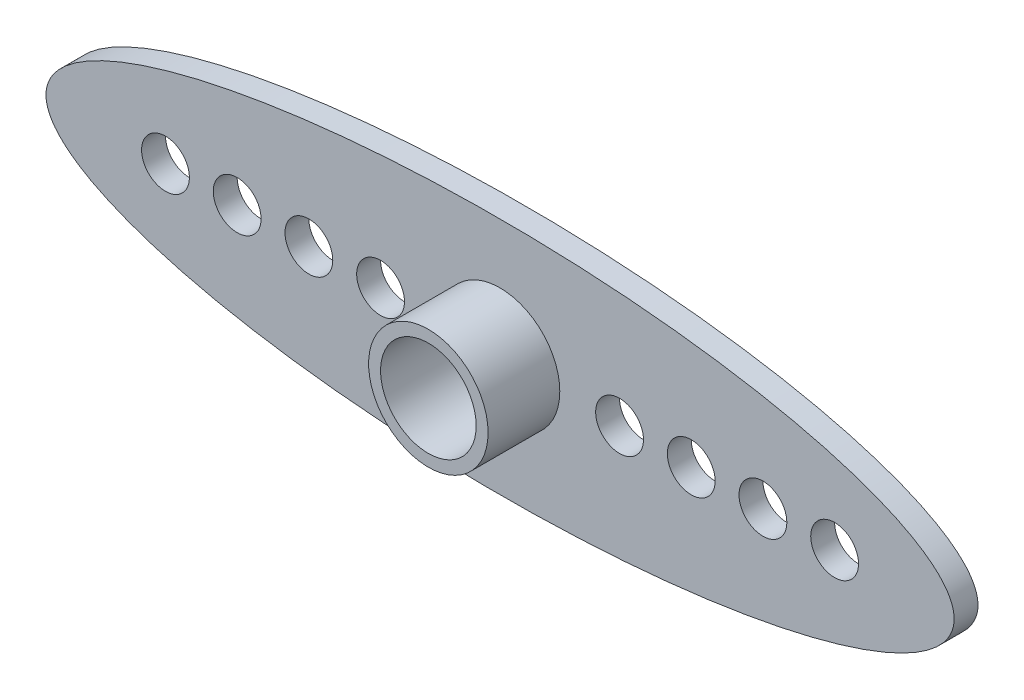
ISO-10303-21;
HEADER;
FILE_DESCRIPTION(('STEP AP214'),'2;1');
FILE_NAME('part.step','',(''),(''),'','','');
FILE_SCHEMA(('AUTOMOTIVE_DESIGN { 1 0 10303 214 1 1 1 1 }'));
ENDSEC;
DATA;
#1=APPLICATION_CONTEXT('core data for automotive mechanical design processes');
#2=APPLICATION_PROTOCOL_DEFINITION('international standard','automotive_design',2000,#1);
#3=PRODUCT_CONTEXT('',#1,'mechanical');
#4=PRODUCT('Part','Part','',(#3));
#5=PRODUCT_RELATED_PRODUCT_CATEGORY('part','',(#4));
#6=PRODUCT_DEFINITION_FORMATION('','',#4);
#7=PRODUCT_DEFINITION_CONTEXT('part definition',#1,'design');
#8=PRODUCT_DEFINITION('design','',#6,#7);
#9=PRODUCT_DEFINITION_SHAPE('','',#8);
#10=(LENGTH_UNIT() NAMED_UNIT(*) SI_UNIT(.MILLI.,.METRE.));
#11=(NAMED_UNIT(*) PLANE_ANGLE_UNIT() SI_UNIT($,.RADIAN.));
#12=(NAMED_UNIT(*) SI_UNIT($,.STERADIAN.) SOLID_ANGLE_UNIT());
#13=UNCERTAINTY_MEASURE_WITH_UNIT(LENGTH_MEASURE(1.E-05),#10,'distance_accuracy_value','');
#14=(GEOMETRIC_REPRESENTATION_CONTEXT(3) GLOBAL_UNCERTAINTY_ASSIGNED_CONTEXT((#13)) GLOBAL_UNIT_ASSIGNED_CONTEXT((#10,
#11,#12)) REPRESENTATION_CONTEXT('',''));
#15=CARTESIAN_POINT('',(0.,0.,0.));
#16=DIRECTION('',(0.,0.,1.));
#17=DIRECTION('',(1.,0.,0.));
#18=AXIS2_PLACEMENT_3D('',#15,#16,#17);
#19=CARTESIAN_POINT('',(0.,0.,0.));
#20=DIRECTION('',(0.,0.,1.));
#21=DIRECTION('',(1.,0.,0.));
#22=AXIS2_PLACEMENT_3D('',#19,#20,#21);
#23=PLANE('',#22);
#24=CARTESIAN_POINT('',(0.,0.,0.));
#25=DIRECTION('',(0.,0.,-1.));
#26=DIRECTION('',(-1.,0.,0.));
#27=AXIS2_PLACEMENT_3D('',#24,#25,#26);
#28=CIRCLE('',#27,1.5);
#29=CARTESIAN_POINT('',(-1.5,0.,0.));
#30=VERTEX_POINT('',#29);
#31=EDGE_CURVE('E56',#30,#30,#28,.T.);
#32=ORIENTED_EDGE('',*,*,#31,.F.);
#33=EDGE_LOOP('',(#32));
#34=FACE_BOUND('',#33,.T.);
#35=CARTESIAN_POINT('',(0.,0.,0.));
#36=DIRECTION('',(0.,0.,-1.));
#37=DIRECTION('',(-1.,0.,0.));
#38=AXIS2_PLACEMENT_3D('',#35,#36,#37);
#39=CIRCLE('',#38,2.);
#40=CARTESIAN_POINT('',(-2.,0.,0.));
#41=VERTEX_POINT('',#40);
#42=EDGE_CURVE('E150',#41,#41,#39,.T.);
#43=ORIENTED_EDGE('',*,*,#42,.T.);
#44=EDGE_LOOP('',(#43));
#45=FACE_BOUND('',#44,.T.);
#46=ADVANCED_FACE('F31',(#34,#45),#23,.F.);
#47=CARTESIAN_POINT('',(0.,0.,1.));
#48=DIRECTION('',(0.,0.,1.));
#49=DIRECTION('',(-1.,0.,0.));
#50=AXIS2_PLACEMENT_3D('',#47,#48,#49);
#51=ELLIPSE('',#50,19.,5.);
#52=DIRECTION('',(0.,0.,-1.));
#53=VECTOR('',#52,1.);
#54=SURFACE_OF_LINEAR_EXTRUSION('',#51,#53);
#55=CARTESIAN_POINT('',(-19.,0.,1.));
#56=VERTEX_POINT('',#55);
#57=EDGE_CURVE('E39',#56,#56,#51,.T.);
#58=ORIENTED_EDGE('',*,*,#57,.F.);
#59=EDGE_LOOP('',(#58));
#60=FACE_BOUND('',#59,.T.);
#61=CARTESIAN_POINT('',(0.,0.,0.));
#62=DIRECTION('',(0.,0.,1.));
#63=DIRECTION('',(-1.,0.,0.));
#64=AXIS2_PLACEMENT_3D('',#61,#62,#63);
#65=ELLIPSE('',#64,19.,5.);
#66=CARTESIAN_POINT('',(-19.,0.,0.));
#67=VERTEX_POINT('',#66);
#68=EDGE_CURVE('E43',#67,#67,#65,.T.);
#69=ORIENTED_EDGE('',*,*,#68,.T.);
#70=EDGE_LOOP('',(#69));
#71=FACE_BOUND('',#70,.T.);
#72=ADVANCED_FACE('F33',(#60,#71),#54,.F.);
#73=CARTESIAN_POINT('',(0.,0.,1.));
#74=DIRECTION('',(0.,0.,1.));
#75=DIRECTION('',(1.,0.,0.));
#76=AXIS2_PLACEMENT_3D('',#73,#74,#75);
#77=PLANE('',#76);
#78=CARTESIAN_POINT('',(-5.,0.,1.));
#79=DIRECTION('',(0.,0.,1.));
#80=DIRECTION('',(1.,0.,0.));
#81=AXIS2_PLACEMENT_3D('',#78,#79,#80);
#82=CIRCLE('',#81,1.);
#83=CARTESIAN_POINT('',(-4.,0.,1.));
#84=VERTEX_POINT('',#83);
#85=EDGE_CURVE('E77',#84,#84,#82,.T.);
#86=ORIENTED_EDGE('',*,*,#85,.F.);
#87=EDGE_LOOP('',(#86));
#88=FACE_BOUND('',#87,.T.);
#89=CARTESIAN_POINT('',(-8.,0.,1.));
#90=DIRECTION('',(0.,0.,1.));
#91=DIRECTION('',(1.,0.,0.));
#92=AXIS2_PLACEMENT_3D('',#89,#90,#91);
#93=CIRCLE('',#92,1.);
#94=CARTESIAN_POINT('',(-7.,0.,1.));
#95=VERTEX_POINT('',#94);
#96=EDGE_CURVE('E83',#95,#95,#93,.T.);
#97=ORIENTED_EDGE('',*,*,#96,.F.);
#98=EDGE_LOOP('',(#97));
#99=FACE_BOUND('',#98,.T.);
#100=CARTESIAN_POINT('',(-11.,0.,1.));
#101=DIRECTION('',(0.,0.,1.));
#102=DIRECTION('',(1.,0.,0.));
#103=AXIS2_PLACEMENT_3D('',#100,#101,#102);
#104=CIRCLE('',#103,1.);
#105=CARTESIAN_POINT('',(-10.,0.,1.));
#106=VERTEX_POINT('',#105);
#107=EDGE_CURVE('E89',#106,#106,#104,.T.);
#108=ORIENTED_EDGE('',*,*,#107,.F.);
#109=EDGE_LOOP('',(#108));
#110=FACE_BOUND('',#109,.T.);
#111=CARTESIAN_POINT('',(-14.,0.,1.));
#112=DIRECTION('',(0.,0.,1.));
#113=DIRECTION('',(1.,0.,0.));
#114=AXIS2_PLACEMENT_3D('',#111,#112,#113);
#115=CIRCLE('',#114,1.);
#116=CARTESIAN_POINT('',(-13.,0.,1.));
#117=VERTEX_POINT('',#116);
#118=EDGE_CURVE('E95',#117,#117,#115,.T.);
#119=ORIENTED_EDGE('',*,*,#118,.F.);
#120=EDGE_LOOP('',(#119));
#121=FACE_BOUND('',#120,.T.);
#122=CARTESIAN_POINT('',(14.,0.,1.));
#123=DIRECTION('',(0.,0.,1.));
#124=DIRECTION('',(1.,0.,0.));
#125=AXIS2_PLACEMENT_3D('',#122,#123,#124);
#126=CIRCLE('',#125,1.);
#127=CARTESIAN_POINT('',(15.,0.,1.));
#128=VERTEX_POINT('',#127);
#129=EDGE_CURVE('E101',#128,#128,#126,.T.);
#130=ORIENTED_EDGE('',*,*,#129,.F.);
#131=EDGE_LOOP('',(#130));
#132=FACE_BOUND('',#131,.T.);
#133=CARTESIAN_POINT('',(11.,0.,1.));
#134=DIRECTION('',(0.,0.,1.));
#135=DIRECTION('',(1.,0.,0.));
#136=AXIS2_PLACEMENT_3D('',#133,#134,#135);
#137=CIRCLE('',#136,1.);
#138=CARTESIAN_POINT('',(12.,0.,1.));
#139=VERTEX_POINT('',#138);
#140=EDGE_CURVE('E107',#139,#139,#137,.T.);
#141=ORIENTED_EDGE('',*,*,#140,.F.);
#142=EDGE_LOOP('',(#141));
#143=FACE_BOUND('',#142,.T.);
#144=CARTESIAN_POINT('',(8.,0.,1.));
#145=DIRECTION('',(0.,0.,1.));
#146=DIRECTION('',(1.,0.,0.));
#147=AXIS2_PLACEMENT_3D('',#144,#145,#146);
#148=CIRCLE('',#147,1.);
#149=CARTESIAN_POINT('',(9.,0.,1.));
#150=VERTEX_POINT('',#149);
#151=EDGE_CURVE('E113',#150,#150,#148,.T.);
#152=ORIENTED_EDGE('',*,*,#151,.F.);
#153=EDGE_LOOP('',(#152));
#154=FACE_BOUND('',#153,.T.);
#155=CARTESIAN_POINT('',(5.,0.,1.));
#156=DIRECTION('',(0.,0.,1.));
#157=DIRECTION('',(1.,0.,0.));
#158=AXIS2_PLACEMENT_3D('',#155,#156,#157);
#159=CIRCLE('',#158,1.);
#160=CARTESIAN_POINT('',(6.,0.,1.));
#161=VERTEX_POINT('',#160);
#162=EDGE_CURVE('E119',#161,#161,#159,.T.);
#163=ORIENTED_EDGE('',*,*,#162,.F.);
#164=EDGE_LOOP('',(#163));
#165=FACE_BOUND('',#164,.T.);
#166=CARTESIAN_POINT('',(0.,0.,1.));
#167=DIRECTION('',(0.,0.,1.));
#168=DIRECTION('',(1.,0.,0.));
#169=AXIS2_PLACEMENT_3D('',#166,#167,#168);
#170=CIRCLE('',#169,2.5);
#171=CARTESIAN_POINT('',(2.5,0.,1.));
#172=VERTEX_POINT('',#171);
#173=EDGE_CURVE('E51',#172,#172,#170,.T.);
#174=ORIENTED_EDGE('',*,*,#173,.F.);
#175=EDGE_LOOP('',(#174));
#176=FACE_BOUND('',#175,.T.);
#177=ORIENTED_EDGE('',*,*,#57,.T.);
#178=EDGE_LOOP('',(#177));
#179=FACE_BOUND('',#178,.T.);
#180=ADVANCED_FACE('F129',(#88,#99,#110,#121,#132,#143,#154,#165,#176,#179),#77,.T.);
#181=CARTESIAN_POINT('',(0.,0.,0.));
#182=DIRECTION('',(0.,0.,1.));
#183=DIRECTION('',(1.,0.,0.));
#184=AXIS2_PLACEMENT_3D('',#181,#182,#183);
#185=CIRCLE('',#184,2.5);
#186=CARTESIAN_POINT('',(2.5,0.,0.));
#187=VERTEX_POINT('',#186);
#188=EDGE_CURVE('E10',#187,#187,#185,.F.);
#189=ORIENTED_EDGE('',*,*,#188,.F.);
#190=EDGE_LOOP('',(#189));
#191=FACE_BOUND('',#190,.T.);
#192=CARTESIAN_POINT('',(-5.,0.,0.));
#193=DIRECTION('',(0.,0.,-1.));
#194=DIRECTION('',(1.,0.,0.));
#195=AXIS2_PLACEMENT_3D('',#192,#193,#194);
#196=CIRCLE('',#195,1.);
#197=CARTESIAN_POINT('',(-4.,0.,0.));
#198=VERTEX_POINT('',#197);
#199=EDGE_CURVE('E73',#198,#198,#196,.T.);
#200=ORIENTED_EDGE('',*,*,#199,.F.);
#201=EDGE_LOOP('',(#200));
#202=FACE_BOUND('',#201,.T.);
#203=CARTESIAN_POINT('',(-8.,0.,0.));
#204=DIRECTION('',(0.,0.,-1.));
#205=DIRECTION('',(1.,0.,0.));
#206=AXIS2_PLACEMENT_3D('',#203,#204,#205);
#207=CIRCLE('',#206,1.);
#208=CARTESIAN_POINT('',(-7.,0.,0.));
#209=VERTEX_POINT('',#208);
#210=EDGE_CURVE('E80',#209,#209,#207,.T.);
#211=ORIENTED_EDGE('',*,*,#210,.F.);
#212=EDGE_LOOP('',(#211));
#213=FACE_BOUND('',#212,.T.);
#214=CARTESIAN_POINT('',(-11.,0.,0.));
#215=DIRECTION('',(0.,0.,-1.));
#216=DIRECTION('',(1.,0.,0.));
#217=AXIS2_PLACEMENT_3D('',#214,#215,#216);
#218=CIRCLE('',#217,1.);
#219=CARTESIAN_POINT('',(-10.,0.,0.));
#220=VERTEX_POINT('',#219);
#221=EDGE_CURVE('E86',#220,#220,#218,.T.);
#222=ORIENTED_EDGE('',*,*,#221,.F.);
#223=EDGE_LOOP('',(#222));
#224=FACE_BOUND('',#223,.T.);
#225=CARTESIAN_POINT('',(-14.,0.,0.));
#226=DIRECTION('',(0.,0.,-1.));
#227=DIRECTION('',(1.,0.,0.));
#228=AXIS2_PLACEMENT_3D('',#225,#226,#227);
#229=CIRCLE('',#228,1.);
#230=CARTESIAN_POINT('',(-13.,0.,0.));
#231=VERTEX_POINT('',#230);
#232=EDGE_CURVE('E92',#231,#231,#229,.T.);
#233=ORIENTED_EDGE('',*,*,#232,.F.);
#234=EDGE_LOOP('',(#233));
#235=FACE_BOUND('',#234,.T.);
#236=CARTESIAN_POINT('',(14.,0.,0.));
#237=DIRECTION('',(0.,0.,-1.));
#238=DIRECTION('',(-1.,0.,0.));
#239=AXIS2_PLACEMENT_3D('',#236,#237,#238);
#240=CIRCLE('',#239,1.);
#241=CARTESIAN_POINT('',(13.,0.,0.));
#242=VERTEX_POINT('',#241);
#243=EDGE_CURVE('E98',#242,#242,#240,.T.);
#244=ORIENTED_EDGE('',*,*,#243,.F.);
#245=EDGE_LOOP('',(#244));
#246=FACE_BOUND('',#245,.T.);
#247=CARTESIAN_POINT('',(11.,0.,0.));
#248=DIRECTION('',(0.,0.,-1.));
#249=DIRECTION('',(-1.,0.,0.));
#250=AXIS2_PLACEMENT_3D('',#247,#248,#249);
#251=CIRCLE('',#250,1.);
#252=CARTESIAN_POINT('',(10.,0.,0.));
#253=VERTEX_POINT('',#252);
#254=EDGE_CURVE('E104',#253,#253,#251,.T.);
#255=ORIENTED_EDGE('',*,*,#254,.F.);
#256=EDGE_LOOP('',(#255));
#257=FACE_BOUND('',#256,.T.);
#258=CARTESIAN_POINT('',(8.,0.,0.));
#259=DIRECTION('',(0.,0.,-1.));
#260=DIRECTION('',(-1.,0.,0.));
#261=AXIS2_PLACEMENT_3D('',#258,#259,#260);
#262=CIRCLE('',#261,1.);
#263=CARTESIAN_POINT('',(7.,0.,0.));
#264=VERTEX_POINT('',#263);
#265=EDGE_CURVE('E110',#264,#264,#262,.T.);
#266=ORIENTED_EDGE('',*,*,#265,.F.);
#267=EDGE_LOOP('',(#266));
#268=FACE_BOUND('',#267,.T.);
#269=CARTESIAN_POINT('',(5.,0.,0.));
#270=DIRECTION('',(0.,0.,-1.));
#271=DIRECTION('',(-1.,0.,0.));
#272=AXIS2_PLACEMENT_3D('',#269,#270,#271);
#273=CIRCLE('',#272,1.);
#274=CARTESIAN_POINT('',(4.,0.,0.));
#275=VERTEX_POINT('',#274);
#276=EDGE_CURVE('E116',#275,#275,#273,.T.);
#277=ORIENTED_EDGE('',*,*,#276,.F.);
#278=EDGE_LOOP('',(#277));
#279=FACE_BOUND('',#278,.T.);
#280=ORIENTED_EDGE('',*,*,#68,.F.);
#281=EDGE_LOOP('',(#280));
#282=FACE_BOUND('',#281,.T.);
#283=ADVANCED_FACE('F131',(#191,#202,#213,#224,#235,#246,#257,#268,#279,#282),#23,.F.);
#284=CARTESIAN_POINT('',(0.,0.,4.));
#285=DIRECTION('',(0.,0.,-1.));
#286=DIRECTION('',(-1.,0.,0.));
#287=AXIS2_PLACEMENT_3D('',#284,#285,#286);
#288=CYLINDRICAL_SURFACE('',#287,2.5);
#289=CARTESIAN_POINT('',(0.,0.,4.));
#290=DIRECTION('',(0.,0.,1.));
#291=DIRECTION('',(1.,0.,0.));
#292=AXIS2_PLACEMENT_3D('',#289,#290,#291);
#293=CIRCLE('',#292,2.5);
#294=CARTESIAN_POINT('',(2.5,0.,4.));
#295=VERTEX_POINT('',#294);
#296=EDGE_CURVE('E47',#295,#295,#293,.T.);
#297=ORIENTED_EDGE('',*,*,#296,.F.);
#298=EDGE_LOOP('',(#297));
#299=FACE_BOUND('',#298,.T.);
#300=ORIENTED_EDGE('',*,*,#173,.T.);
#301=EDGE_LOOP('',(#300));
#302=FACE_BOUND('',#301,.T.);
#303=ADVANCED_FACE('F127',(#299,#302),#288,.T.);
#304=CARTESIAN_POINT('',(0.,0.,4.));
#305=DIRECTION('',(0.,0.,1.));
#306=DIRECTION('',(1.,0.,0.));
#307=AXIS2_PLACEMENT_3D('',#304,#305,#306);
#308=PLANE('',#307);
#309=CARTESIAN_POINT('',(0.,0.,4.));
#310=DIRECTION('',(0.,0.,1.));
#311=DIRECTION('',(1.,0.,0.));
#312=AXIS2_PLACEMENT_3D('',#309,#310,#311);
#313=CIRCLE('',#312,2.);
#314=CARTESIAN_POINT('',(2.,0.,4.));
#315=VERTEX_POINT('',#314);
#316=EDGE_CURVE('E55',#315,#315,#313,.T.);
#317=ORIENTED_EDGE('',*,*,#316,.F.);
#318=EDGE_LOOP('',(#317));
#319=FACE_BOUND('',#318,.T.);
#320=ORIENTED_EDGE('',*,*,#296,.T.);
#321=EDGE_LOOP('',(#320));
#322=FACE_BOUND('',#321,.T.);
#323=ADVANCED_FACE('F212',(#319,#322),#308,.T.);
#324=CARTESIAN_POINT('',(5.,0.,4.));
#325=DIRECTION('',(0.,0.,-1.));
#326=DIRECTION('',(-1.,0.,0.));
#327=AXIS2_PLACEMENT_3D('',#324,#325,#326);
#328=CYLINDRICAL_SURFACE('',#327,1.);
#329=ORIENTED_EDGE('',*,*,#162,.T.);
#330=EDGE_LOOP('',(#329));
#331=FACE_BOUND('',#330,.T.);
#332=ORIENTED_EDGE('',*,*,#276,.T.);
#333=EDGE_LOOP('',(#332));
#334=FACE_BOUND('',#333,.T.);
#335=ADVANCED_FACE('F208',(#331,#334),#328,.F.);
#336=CARTESIAN_POINT('',(8.,0.,4.));
#337=DIRECTION('',(0.,0.,-1.));
#338=DIRECTION('',(-1.,0.,0.));
#339=AXIS2_PLACEMENT_3D('',#336,#337,#338);
#340=CYLINDRICAL_SURFACE('',#339,1.);
#341=ORIENTED_EDGE('',*,*,#151,.T.);
#342=EDGE_LOOP('',(#341));
#343=FACE_BOUND('',#342,.T.);
#344=ORIENTED_EDGE('',*,*,#265,.T.);
#345=EDGE_LOOP('',(#344));
#346=FACE_BOUND('',#345,.T.);
#347=ADVANCED_FACE('F204',(#343,#346),#340,.F.);
#348=CARTESIAN_POINT('',(11.,0.,4.));
#349=DIRECTION('',(0.,0.,-1.));
#350=DIRECTION('',(-1.,0.,0.));
#351=AXIS2_PLACEMENT_3D('',#348,#349,#350);
#352=CYLINDRICAL_SURFACE('',#351,1.);
#353=ORIENTED_EDGE('',*,*,#140,.T.);
#354=EDGE_LOOP('',(#353));
#355=FACE_BOUND('',#354,.T.);
#356=ORIENTED_EDGE('',*,*,#254,.T.);
#357=EDGE_LOOP('',(#356));
#358=FACE_BOUND('',#357,.T.);
#359=ADVANCED_FACE('F200',(#355,#358),#352,.F.);
#360=CARTESIAN_POINT('',(14.,0.,4.));
#361=DIRECTION('',(0.,0.,-1.));
#362=DIRECTION('',(-1.,0.,0.));
#363=AXIS2_PLACEMENT_3D('',#360,#361,#362);
#364=CYLINDRICAL_SURFACE('',#363,1.);
#365=ORIENTED_EDGE('',*,*,#129,.T.);
#366=EDGE_LOOP('',(#365));
#367=FACE_BOUND('',#366,.T.);
#368=ORIENTED_EDGE('',*,*,#243,.T.);
#369=EDGE_LOOP('',(#368));
#370=FACE_BOUND('',#369,.T.);
#371=ADVANCED_FACE('F196',(#367,#370),#364,.F.);
#372=CARTESIAN_POINT('',(-14.,0.,4.));
#373=DIRECTION('',(0.,0.,-1.));
#374=DIRECTION('',(-1.,0.,0.));
#375=AXIS2_PLACEMENT_3D('',#372,#373,#374);
#376=CYLINDRICAL_SURFACE('',#375,1.);
#377=ORIENTED_EDGE('',*,*,#118,.T.);
#378=EDGE_LOOP('',(#377));
#379=FACE_BOUND('',#378,.T.);
#380=ORIENTED_EDGE('',*,*,#232,.T.);
#381=EDGE_LOOP('',(#380));
#382=FACE_BOUND('',#381,.T.);
#383=ADVANCED_FACE('F192',(#379,#382),#376,.F.);
#384=CARTESIAN_POINT('',(-11.,0.,4.));
#385=DIRECTION('',(0.,0.,-1.));
#386=DIRECTION('',(-1.,0.,0.));
#387=AXIS2_PLACEMENT_3D('',#384,#385,#386);
#388=CYLINDRICAL_SURFACE('',#387,1.);
#389=ORIENTED_EDGE('',*,*,#107,.T.);
#390=EDGE_LOOP('',(#389));
#391=FACE_BOUND('',#390,.T.);
#392=ORIENTED_EDGE('',*,*,#221,.T.);
#393=EDGE_LOOP('',(#392));
#394=FACE_BOUND('',#393,.T.);
#395=ADVANCED_FACE('F188',(#391,#394),#388,.F.);
#396=CARTESIAN_POINT('',(-8.,0.,4.));
#397=DIRECTION('',(0.,0.,-1.));
#398=DIRECTION('',(-1.,0.,0.));
#399=AXIS2_PLACEMENT_3D('',#396,#397,#398);
#400=CYLINDRICAL_SURFACE('',#399,1.);
#401=ORIENTED_EDGE('',*,*,#96,.T.);
#402=EDGE_LOOP('',(#401));
#403=FACE_BOUND('',#402,.T.);
#404=ORIENTED_EDGE('',*,*,#210,.T.);
#405=EDGE_LOOP('',(#404));
#406=FACE_BOUND('',#405,.T.);
#407=ADVANCED_FACE('F184',(#403,#406),#400,.F.);
#408=CARTESIAN_POINT('',(-5.,0.,4.));
#409=DIRECTION('',(0.,0.,-1.));
#410=DIRECTION('',(-1.,0.,0.));
#411=AXIS2_PLACEMENT_3D('',#408,#409,#410);
#412=CYLINDRICAL_SURFACE('',#411,1.);
#413=ORIENTED_EDGE('',*,*,#85,.T.);
#414=EDGE_LOOP('',(#413));
#415=FACE_BOUND('',#414,.T.);
#416=ORIENTED_EDGE('',*,*,#199,.T.);
#417=EDGE_LOOP('',(#416));
#418=FACE_BOUND('',#417,.T.);
#419=ADVANCED_FACE('F180',(#415,#418),#412,.F.);
#420=CARTESIAN_POINT('',(0.,0.,1.));
#421=DIRECTION('',(0.,0.,1.));
#422=DIRECTION('',(1.,0.,0.));
#423=AXIS2_PLACEMENT_3D('',#420,#421,#422);
#424=CYLINDRICAL_SURFACE('',#423,2.);
#425=CARTESIAN_POINT('',(0.,0.,1.));
#426=DIRECTION('',(0.,0.,1.));
#427=DIRECTION('',(1.,0.,0.));
#428=AXIS2_PLACEMENT_3D('',#425,#426,#427);
#429=CIRCLE('',#428,2.);
#430=CARTESIAN_POINT('',(2.,0.,1.));
#431=VERTEX_POINT('',#430);
#432=EDGE_CURVE('E60',#431,#431,#429,.T.);
#433=ORIENTED_EDGE('',*,*,#432,.F.);
#434=EDGE_LOOP('',(#433));
#435=FACE_BOUND('',#434,.T.);
#436=ORIENTED_EDGE('',*,*,#316,.T.);
#437=EDGE_LOOP('',(#436));
#438=FACE_BOUND('',#437,.T.);
#439=ADVANCED_FACE('F176',(#435,#438),#424,.F.);
#440=CARTESIAN_POINT('',(0.,0.,1.));
#441=DIRECTION('',(0.,0.,1.));
#442=DIRECTION('',(1.,0.,0.));
#443=AXIS2_PLACEMENT_3D('',#440,#441,#442);
#444=PLANE('',#443);
#445=CARTESIAN_POINT('',(0.,0.,1.));
#446=DIRECTION('',(0.,0.,1.));
#447=DIRECTION('',(1.,0.,0.));
#448=AXIS2_PLACEMENT_3D('',#445,#446,#447);
#449=CIRCLE('',#448,1.5);
#450=CARTESIAN_POINT('',(1.5,0.,1.));
#451=VERTEX_POINT('',#450);
#452=EDGE_CURVE('E53',#451,#451,#449,.T.);
#453=ORIENTED_EDGE('',*,*,#452,.F.);
#454=EDGE_LOOP('',(#453));
#455=FACE_BOUND('',#454,.T.);
#456=ORIENTED_EDGE('',*,*,#432,.T.);
#457=EDGE_LOOP('',(#456));
#458=FACE_BOUND('',#457,.T.);
#459=ADVANCED_FACE('F170',(#455,#458),#444,.T.);
#460=CARTESIAN_POINT('',(0.,0.,3.));
#461=DIRECTION('',(0.,0.,-1.));
#462=DIRECTION('',(-1.,0.,0.));
#463=AXIS2_PLACEMENT_3D('',#460,#461,#462);
#464=CYLINDRICAL_SURFACE('',#463,1.5);
#465=ORIENTED_EDGE('',*,*,#452,.T.);
#466=EDGE_LOOP('',(#465));
#467=FACE_BOUND('',#466,.T.);
#468=ORIENTED_EDGE('',*,*,#31,.T.);
#469=EDGE_LOOP('',(#468));
#470=FACE_BOUND('',#469,.T.);
#471=ADVANCED_FACE('F161',(#467,#470),#464,.F.);
#472=CARTESIAN_POINT('',(0.,0.,-1.));
#473=DIRECTION('',(0.,0.,-1.));
#474=DIRECTION('',(-1.,0.,0.));
#475=AXIS2_PLACEMENT_3D('',#472,#473,#474);
#476=PLANE('',#475);
#477=CARTESIAN_POINT('',(0.,0.,-1.));
#478=DIRECTION('',(0.,0.,-1.));
#479=DIRECTION('',(-1.,0.,0.));
#480=AXIS2_PLACEMENT_3D('',#477,#478,#479);
#481=CIRCLE('',#480,2.5);
#482=CARTESIAN_POINT('',(-2.5,0.,-1.));
#483=VERTEX_POINT('',#482);
#484=EDGE_CURVE('E63',#483,#483,#481,.T.);
#485=ORIENTED_EDGE('',*,*,#484,.T.);
#486=EDGE_LOOP('',(#485));
#487=FACE_BOUND('',#486,.T.);
#488=CARTESIAN_POINT('',(0.,0.,-1.));
#489=DIRECTION('',(0.,0.,-1.));
#490=DIRECTION('',(-1.,0.,0.));
#491=AXIS2_PLACEMENT_3D('',#488,#489,#490);
#492=CIRCLE('',#491,2.);
#493=CARTESIAN_POINT('',(-2.,0.,-1.));
#494=VERTEX_POINT('',#493);
#495=EDGE_CURVE('E68',#494,#494,#492,.T.);
#496=ORIENTED_EDGE('',*,*,#495,.F.);
#497=EDGE_LOOP('',(#496));
#498=FACE_BOUND('',#497,.T.);
#499=ADVANCED_FACE('F158',(#487,#498),#476,.T.);
#500=CARTESIAN_POINT('',(0.,0.,-1.));
#501=DIRECTION('',(0.,0.,1.));
#502=DIRECTION('',(1.,0.,0.));
#503=AXIS2_PLACEMENT_3D('',#500,#501,#502);
#504=CYLINDRICAL_SURFACE('',#503,2.5);
#505=ORIENTED_EDGE('',*,*,#484,.F.);
#506=EDGE_LOOP('',(#505));
#507=FACE_BOUND('',#506,.T.);
#508=ORIENTED_EDGE('',*,*,#188,.T.);
#509=EDGE_LOOP('',(#508));
#510=FACE_BOUND('',#509,.T.);
#511=ADVANCED_FACE('F160',(#507,#510),#504,.T.);
#512=CARTESIAN_POINT('',(0.,0.,-1.));
#513=DIRECTION('',(0.,0.,1.));
#514=DIRECTION('',(1.,0.,0.));
#515=AXIS2_PLACEMENT_3D('',#512,#513,#514);
#516=CYLINDRICAL_SURFACE('',#515,2.);
#517=ORIENTED_EDGE('',*,*,#495,.T.);
#518=EDGE_LOOP('',(#517));
#519=FACE_BOUND('',#518,.T.);
#520=ORIENTED_EDGE('',*,*,#42,.F.);
#521=EDGE_LOOP('',(#520));
#522=FACE_BOUND('',#521,.T.);
#523=ADVANCED_FACE('F156',(#519,#522),#516,.F.);
#524=CLOSED_SHELL('',(#46,#72,#180,#283,#303,#323,#335,#347,#359,#371,#383,#395,#407,#419,#439,
#459,#471,#499,#511,#523));
#525=MANIFOLD_SOLID_BREP('B2',#524);
#526=ADVANCED_BREP_SHAPE_REPRESENTATION('',(#18,#525),#14);
#527=SHAPE_DEFINITION_REPRESENTATION(#9,#526);
ENDSEC;
END-ISO-10303-21;
